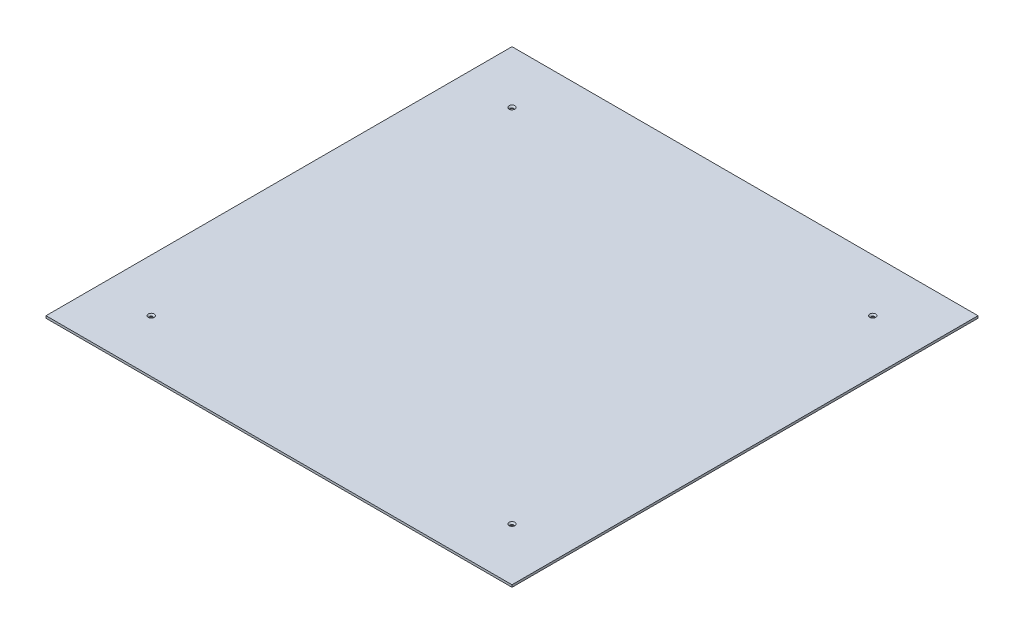
ISO-10303-21;
HEADER;
FILE_DESCRIPTION(('STEP AP214'),'2;1');
FILE_NAME('part.step','',(''),(''),'','','');
FILE_SCHEMA(('AUTOMOTIVE_DESIGN { 1 0 10303 214 1 1 1 1 }'));
ENDSEC;
DATA;
#1=APPLICATION_CONTEXT('core data for automotive mechanical design processes');
#2=APPLICATION_PROTOCOL_DEFINITION('international standard','automotive_design',2000,#1);
#3=PRODUCT_CONTEXT('',#1,'mechanical');
#4=PRODUCT('Part','Part','',(#3));
#5=PRODUCT_RELATED_PRODUCT_CATEGORY('part','',(#4));
#6=PRODUCT_DEFINITION_FORMATION('','',#4);
#7=PRODUCT_DEFINITION_CONTEXT('part definition',#1,'design');
#8=PRODUCT_DEFINITION('design','',#6,#7);
#9=PRODUCT_DEFINITION_SHAPE('','',#8);
#10=(LENGTH_UNIT() NAMED_UNIT(*) SI_UNIT(.MILLI.,.METRE.));
#11=(NAMED_UNIT(*) PLANE_ANGLE_UNIT() SI_UNIT($,.RADIAN.));
#12=(NAMED_UNIT(*) SI_UNIT($,.STERADIAN.) SOLID_ANGLE_UNIT());
#13=UNCERTAINTY_MEASURE_WITH_UNIT(LENGTH_MEASURE(1.E-05),#10,'distance_accuracy_value','');
#14=(GEOMETRIC_REPRESENTATION_CONTEXT(3) GLOBAL_UNCERTAINTY_ASSIGNED_CONTEXT((#13)) GLOBAL_UNIT_ASSIGNED_CONTEXT((#10,
#11,#12)) REPRESENTATION_CONTEXT('',''));
#15=CARTESIAN_POINT('',(0.,0.,0.));
#16=DIRECTION('',(0.,0.,1.));
#17=DIRECTION('',(1.,0.,0.));
#18=AXIS2_PLACEMENT_3D('',#15,#16,#17);
#19=CARTESIAN_POINT('',(155.,1.5,-155.));
#20=DIRECTION('',(-1.,0.,0.));
#21=DIRECTION('',(0.,0.,1.));
#22=AXIS2_PLACEMENT_3D('',#19,#20,#21);
#23=PLANE('',#22);
#24=DIRECTION('',(0.,0.,-1.));
#25=VECTOR('',#24,1.);
#26=CARTESIAN_POINT('',(155.,0.,-155.));
#27=LINE('',#26,#25);
#28=CARTESIAN_POINT('',(155.,0.,155.));
#29=VERTEX_POINT('',#28);
#30=CARTESIAN_POINT('',(155.,0.,-155.));
#31=VERTEX_POINT('',#30);
#32=EDGE_CURVE('E109',#29,#31,#27,.T.);
#33=ORIENTED_EDGE('',*,*,#32,.T.);
#34=DIRECTION('',(0.,-1.,0.));
#35=VECTOR('',#34,1.);
#36=CARTESIAN_POINT('',(155.,1.5,-155.));
#37=LINE('',#36,#35);
#38=CARTESIAN_POINT('',(155.,1.5,-155.));
#39=VERTEX_POINT('',#38);
#40=EDGE_CURVE('E11',#39,#31,#37,.T.);
#41=ORIENTED_EDGE('',*,*,#40,.F.);
#42=DIRECTION('',(0.,0.,-1.));
#43=VECTOR('',#42,1.);
#44=CARTESIAN_POINT('',(155.,1.5,-155.));
#45=LINE('',#44,#43);
#46=CARTESIAN_POINT('',(155.,1.5,155.));
#47=VERTEX_POINT('',#46);
#48=EDGE_CURVE('E93',#47,#39,#45,.T.);
#49=ORIENTED_EDGE('',*,*,#48,.F.);
#50=DIRECTION('',(0.,-1.,0.));
#51=VECTOR('',#50,1.);
#52=CARTESIAN_POINT('',(155.,1.5,155.));
#53=LINE('',#52,#51);
#54=EDGE_CURVE('E105',#47,#29,#53,.T.);
#55=ORIENTED_EDGE('',*,*,#54,.T.);
#56=EDGE_LOOP('',(#33,#41,#49,#55));
#57=FACE_BOUND('',#56,.T.);
#58=ADVANCED_FACE('F41',(#57),#23,.F.);
#59=CARTESIAN_POINT('',(-155.,1.5,-155.));
#60=DIRECTION('',(0.,0.,1.));
#61=DIRECTION('',(1.,0.,0.));
#62=AXIS2_PLACEMENT_3D('',#59,#60,#61);
#63=PLANE('',#62);
#64=DIRECTION('',(-1.,0.,0.));
#65=VECTOR('',#64,1.);
#66=CARTESIAN_POINT('',(-155.,0.,-155.));
#67=LINE('',#66,#65);
#68=CARTESIAN_POINT('',(-155.,0.,-155.));
#69=VERTEX_POINT('',#68);
#70=EDGE_CURVE('E98',#31,#69,#67,.T.);
#71=ORIENTED_EDGE('',*,*,#70,.T.);
#72=DIRECTION('',(0.,-1.,0.));
#73=VECTOR('',#72,1.);
#74=CARTESIAN_POINT('',(-155.,1.5,-155.));
#75=LINE('',#74,#73);
#76=CARTESIAN_POINT('',(-155.,1.5,-155.));
#77=VERTEX_POINT('',#76);
#78=EDGE_CURVE('E50',#77,#69,#75,.T.);
#79=ORIENTED_EDGE('',*,*,#78,.F.);
#80=DIRECTION('',(-1.,0.,0.));
#81=VECTOR('',#80,1.);
#82=CARTESIAN_POINT('',(-155.,1.5,-155.));
#83=LINE('',#82,#81);
#84=EDGE_CURVE('E88',#39,#77,#83,.T.);
#85=ORIENTED_EDGE('',*,*,#84,.F.);
#86=ORIENTED_EDGE('',*,*,#40,.T.);
#87=EDGE_LOOP('',(#71,#79,#85,#86));
#88=FACE_BOUND('',#87,.T.);
#89=ADVANCED_FACE('F97',(#88),#63,.F.);
#90=CARTESIAN_POINT('',(-155.,1.5,-155.));
#91=DIRECTION('',(1.,0.,0.));
#92=DIRECTION('',(0.,0.,-1.));
#93=AXIS2_PLACEMENT_3D('',#90,#91,#92);
#94=PLANE('',#93);
#95=DIRECTION('',(0.,0.,1.));
#96=VECTOR('',#95,1.);
#97=CARTESIAN_POINT('',(-155.,0.,-155.));
#98=LINE('',#97,#96);
#99=CARTESIAN_POINT('',(-155.,0.,155.));
#100=VERTEX_POINT('',#99);
#101=EDGE_CURVE('E75',#69,#100,#98,.T.);
#102=ORIENTED_EDGE('',*,*,#101,.T.);
#103=DIRECTION('',(0.,-1.,0.));
#104=VECTOR('',#103,1.);
#105=CARTESIAN_POINT('',(-155.,1.5,155.));
#106=LINE('',#105,#104);
#107=CARTESIAN_POINT('',(-155.,1.5,155.));
#108=VERTEX_POINT('',#107);
#109=EDGE_CURVE('E100',#108,#100,#106,.T.);
#110=ORIENTED_EDGE('',*,*,#109,.F.);
#111=DIRECTION('',(0.,0.,1.));
#112=VECTOR('',#111,1.);
#113=CARTESIAN_POINT('',(-155.,1.5,-155.));
#114=LINE('',#113,#112);
#115=EDGE_CURVE('E91',#77,#108,#114,.T.);
#116=ORIENTED_EDGE('',*,*,#115,.F.);
#117=ORIENTED_EDGE('',*,*,#78,.T.);
#118=EDGE_LOOP('',(#102,#110,#116,#117));
#119=FACE_BOUND('',#118,.T.);
#120=ADVANCED_FACE('F101',(#119),#94,.F.);
#121=CARTESIAN_POINT('',(-155.,1.5,155.));
#122=DIRECTION('',(0.,0.,-1.));
#123=DIRECTION('',(-1.,0.,0.));
#124=AXIS2_PLACEMENT_3D('',#121,#122,#123);
#125=PLANE('',#124);
#126=DIRECTION('',(1.,0.,0.));
#127=VECTOR('',#126,1.);
#128=CARTESIAN_POINT('',(-155.,0.,155.));
#129=LINE('',#128,#127);
#130=EDGE_CURVE('E81',#100,#29,#129,.T.);
#131=ORIENTED_EDGE('',*,*,#130,.T.);
#132=ORIENTED_EDGE('',*,*,#54,.F.);
#133=DIRECTION('',(1.,0.,0.));
#134=VECTOR('',#133,1.);
#135=CARTESIAN_POINT('',(-155.,1.5,155.));
#136=LINE('',#135,#134);
#137=EDGE_CURVE('E58',#108,#47,#136,.T.);
#138=ORIENTED_EDGE('',*,*,#137,.F.);
#139=ORIENTED_EDGE('',*,*,#109,.T.);
#140=EDGE_LOOP('',(#131,#132,#138,#139));
#141=FACE_BOUND('',#140,.T.);
#142=ADVANCED_FACE('F123',(#141),#125,.F.);
#143=CARTESIAN_POINT('',(0.,1.5,0.));
#144=DIRECTION('',(0.,1.,0.));
#145=DIRECTION('',(0.,0.,1.));
#146=AXIS2_PLACEMENT_3D('',#143,#144,#145);
#147=PLANE('',#146);
#148=CARTESIAN_POINT('',(-120.,1.5,-120.));
#149=DIRECTION('',(0.,1.,0.));
#150=DIRECTION('',(0.,0.,1.));
#151=AXIS2_PLACEMENT_3D('',#148,#149,#150);
#152=CIRCLE('',#151,2.);
#153=CARTESIAN_POINT('',(-120.,1.5,-118.));
#154=VERTEX_POINT('',#153);
#155=EDGE_CURVE('E173',#154,#154,#152,.T.);
#156=ORIENTED_EDGE('',*,*,#155,.F.);
#157=EDGE_LOOP('',(#156));
#158=FACE_BOUND('',#157,.T.);
#159=CARTESIAN_POINT('',(120.,1.5,-120.));
#160=DIRECTION('',(0.,1.,0.));
#161=DIRECTION('',(0.,0.,1.));
#162=AXIS2_PLACEMENT_3D('',#159,#160,#161);
#163=CIRCLE('',#162,2.);
#164=CARTESIAN_POINT('',(120.,1.5,-118.));
#165=VERTEX_POINT('',#164);
#166=EDGE_CURVE('E161',#165,#165,#163,.T.);
#167=ORIENTED_EDGE('',*,*,#166,.F.);
#168=EDGE_LOOP('',(#167));
#169=FACE_BOUND('',#168,.T.);
#170=CARTESIAN_POINT('',(120.000000000002,1.5,120.));
#171=DIRECTION('',(0.,1.,0.));
#172=DIRECTION('',(0.,0.,1.));
#173=AXIS2_PLACEMENT_3D('',#170,#171,#172);
#174=CIRCLE('',#173,2.);
#175=CARTESIAN_POINT('',(120.000000000002,1.5,122.));
#176=VERTEX_POINT('',#175);
#177=EDGE_CURVE('E149',#176,#176,#174,.T.);
#178=ORIENTED_EDGE('',*,*,#177,.F.);
#179=EDGE_LOOP('',(#178));
#180=FACE_BOUND('',#179,.T.);
#181=CARTESIAN_POINT('',(-119.999999999998,1.5,120.));
#182=DIRECTION('',(0.,1.,0.));
#183=DIRECTION('',(0.,0.,1.));
#184=AXIS2_PLACEMENT_3D('',#181,#182,#183);
#185=CIRCLE('',#184,2.);
#186=CARTESIAN_POINT('',(-119.999999999998,1.5,122.));
#187=VERTEX_POINT('',#186);
#188=EDGE_CURVE('E137',#187,#187,#185,.T.);
#189=ORIENTED_EDGE('',*,*,#188,.F.);
#190=EDGE_LOOP('',(#189));
#191=FACE_BOUND('',#190,.T.);
#192=ORIENTED_EDGE('',*,*,#48,.T.);
#193=ORIENTED_EDGE('',*,*,#84,.T.);
#194=ORIENTED_EDGE('',*,*,#115,.T.);
#195=ORIENTED_EDGE('',*,*,#137,.T.);
#196=EDGE_LOOP('',(#192,#193,#194,#195));
#197=FACE_BOUND('',#196,.T.);
#198=ADVANCED_FACE('F89',(#158,#169,#180,#191,#197),#147,.T.);
#199=CARTESIAN_POINT('',(0.,0.,0.));
#200=DIRECTION('',(0.,1.,0.));
#201=DIRECTION('',(0.,0.,1.));
#202=AXIS2_PLACEMENT_3D('',#199,#200,#201);
#203=PLANE('',#202);
#204=CARTESIAN_POINT('',(-120.,0.,-120.));
#205=DIRECTION('',(0.,1.,0.));
#206=DIRECTION('',(0.,0.,1.));
#207=AXIS2_PLACEMENT_3D('',#204,#205,#206);
#208=CIRCLE('',#207,1.05);
#209=CARTESIAN_POINT('',(-120.,0.,-118.95));
#210=VERTEX_POINT('',#209);
#211=EDGE_CURVE('E165',#210,#210,#208,.T.);
#212=ORIENTED_EDGE('',*,*,#211,.T.);
#213=EDGE_LOOP('',(#212));
#214=FACE_BOUND('',#213,.T.);
#215=CARTESIAN_POINT('',(120.,0.,-120.));
#216=DIRECTION('',(0.,1.,0.));
#217=DIRECTION('',(0.,0.,1.));
#218=AXIS2_PLACEMENT_3D('',#215,#216,#217);
#219=CIRCLE('',#218,1.05);
#220=CARTESIAN_POINT('',(120.,0.,-118.95));
#221=VERTEX_POINT('',#220);
#222=EDGE_CURVE('E153',#221,#221,#219,.T.);
#223=ORIENTED_EDGE('',*,*,#222,.T.);
#224=EDGE_LOOP('',(#223));
#225=FACE_BOUND('',#224,.T.);
#226=CARTESIAN_POINT('',(120.000000000002,0.,120.));
#227=DIRECTION('',(0.,1.,0.));
#228=DIRECTION('',(0.,0.,1.));
#229=AXIS2_PLACEMENT_3D('',#226,#227,#228);
#230=CIRCLE('',#229,1.05);
#231=CARTESIAN_POINT('',(120.000000000002,0.,121.05));
#232=VERTEX_POINT('',#231);
#233=EDGE_CURVE('E141',#232,#232,#230,.T.);
#234=ORIENTED_EDGE('',*,*,#233,.T.);
#235=EDGE_LOOP('',(#234));
#236=FACE_BOUND('',#235,.T.);
#237=CARTESIAN_POINT('',(-119.999999999998,0.,120.));
#238=DIRECTION('',(0.,1.,0.));
#239=DIRECTION('',(0.,0.,1.));
#240=AXIS2_PLACEMENT_3D('',#237,#238,#239);
#241=CIRCLE('',#240,1.05);
#242=CARTESIAN_POINT('',(-119.999999999998,0.,121.05));
#243=VERTEX_POINT('',#242);
#244=EDGE_CURVE('E113',#243,#243,#241,.T.);
#245=ORIENTED_EDGE('',*,*,#244,.T.);
#246=EDGE_LOOP('',(#245));
#247=FACE_BOUND('',#246,.T.);
#248=ORIENTED_EDGE('',*,*,#32,.F.);
#249=ORIENTED_EDGE('',*,*,#130,.F.);
#250=ORIENTED_EDGE('',*,*,#101,.F.);
#251=ORIENTED_EDGE('',*,*,#70,.F.);
#252=EDGE_LOOP('',(#248,#249,#250,#251));
#253=FACE_BOUND('',#252,.T.);
#254=ADVANCED_FACE('F126',(#214,#225,#236,#247,#253),#203,.F.);
#255=CARTESIAN_POINT('',(-119.999999999998,1.5,120.));
#256=DIRECTION('',(0.,1.,0.));
#257=DIRECTION('',(0.,0.,1.));
#258=AXIS2_PLACEMENT_3D('',#255,#256,#257);
#259=CYLINDRICAL_SURFACE('',#258,1.05);
#260=ORIENTED_EDGE('',*,*,#244,.F.);
#261=EDGE_LOOP('',(#260));
#262=FACE_BOUND('',#261,.T.);
#263=CARTESIAN_POINT('',(-119.999999999998,0.55,120.));
#264=DIRECTION('',(0.,1.,0.));
#265=DIRECTION('',(0.,0.,1.));
#266=AXIS2_PLACEMENT_3D('',#263,#264,#265);
#267=CIRCLE('',#266,1.05);
#268=CARTESIAN_POINT('',(-119.999999999998,0.55,121.05));
#269=VERTEX_POINT('',#268);
#270=EDGE_CURVE('E133',#269,#269,#267,.T.);
#271=ORIENTED_EDGE('',*,*,#270,.T.);
#272=EDGE_LOOP('',(#271));
#273=FACE_BOUND('',#272,.T.);
#274=ADVANCED_FACE('F192',(#262,#273),#259,.F.);
#275=CARTESIAN_POINT('',(-119.999999999998,1.5,120.));
#276=DIRECTION('',(0.,1.,0.));
#277=DIRECTION('',(0.,0.,1.));
#278=AXIS2_PLACEMENT_3D('',#275,#276,#277);
#279=CONICAL_SURFACE('',#278,2.,0.785398163397451);
#280=ORIENTED_EDGE('',*,*,#270,.F.);
#281=EDGE_LOOP('',(#280));
#282=FACE_BOUND('',#281,.T.);
#283=ORIENTED_EDGE('',*,*,#188,.T.);
#284=EDGE_LOOP('',(#283));
#285=FACE_BOUND('',#284,.T.);
#286=ADVANCED_FACE('F189',(#282,#285),#279,.F.);
#287=CARTESIAN_POINT('',(120.000000000002,1.5,120.));
#288=DIRECTION('',(0.,1.,0.));
#289=DIRECTION('',(0.,0.,1.));
#290=AXIS2_PLACEMENT_3D('',#287,#288,#289);
#291=CYLINDRICAL_SURFACE('',#290,1.05);
#292=ORIENTED_EDGE('',*,*,#233,.F.);
#293=EDGE_LOOP('',(#292));
#294=FACE_BOUND('',#293,.T.);
#295=CARTESIAN_POINT('',(120.000000000002,0.55,120.));
#296=DIRECTION('',(0.,1.,0.));
#297=DIRECTION('',(0.,0.,1.));
#298=AXIS2_PLACEMENT_3D('',#295,#296,#297);
#299=CIRCLE('',#298,1.05);
#300=CARTESIAN_POINT('',(120.000000000002,0.55,121.05));
#301=VERTEX_POINT('',#300);
#302=EDGE_CURVE('E145',#301,#301,#299,.T.);
#303=ORIENTED_EDGE('',*,*,#302,.T.);
#304=EDGE_LOOP('',(#303));
#305=FACE_BOUND('',#304,.T.);
#306=ADVANCED_FACE('F191',(#294,#305),#291,.F.);
#307=CARTESIAN_POINT('',(120.000000000002,1.5,120.));
#308=DIRECTION('',(0.,1.,0.));
#309=DIRECTION('',(0.,0.,1.));
#310=AXIS2_PLACEMENT_3D('',#307,#308,#309);
#311=CONICAL_SURFACE('',#310,2.,0.785398163397451);
#312=ORIENTED_EDGE('',*,*,#302,.F.);
#313=EDGE_LOOP('',(#312));
#314=FACE_BOUND('',#313,.T.);
#315=ORIENTED_EDGE('',*,*,#177,.T.);
#316=EDGE_LOOP('',(#315));
#317=FACE_BOUND('',#316,.T.);
#318=ADVANCED_FACE('F199',(#314,#317),#311,.F.);
#319=CARTESIAN_POINT('',(120.,1.5,-120.));
#320=DIRECTION('',(0.,1.,0.));
#321=DIRECTION('',(0.,0.,1.));
#322=AXIS2_PLACEMENT_3D('',#319,#320,#321);
#323=CYLINDRICAL_SURFACE('',#322,1.05);
#324=ORIENTED_EDGE('',*,*,#222,.F.);
#325=EDGE_LOOP('',(#324));
#326=FACE_BOUND('',#325,.T.);
#327=CARTESIAN_POINT('',(120.,0.55,-120.));
#328=DIRECTION('',(0.,1.,0.));
#329=DIRECTION('',(0.,0.,1.));
#330=AXIS2_PLACEMENT_3D('',#327,#328,#329);
#331=CIRCLE('',#330,1.05);
#332=CARTESIAN_POINT('',(120.,0.55,-118.95));
#333=VERTEX_POINT('',#332);
#334=EDGE_CURVE('E157',#333,#333,#331,.T.);
#335=ORIENTED_EDGE('',*,*,#334,.T.);
#336=EDGE_LOOP('',(#335));
#337=FACE_BOUND('',#336,.T.);
#338=ADVANCED_FACE('F233',(#326,#337),#323,.F.);
#339=CARTESIAN_POINT('',(120.,1.5,-120.));
#340=DIRECTION('',(0.,1.,0.));
#341=DIRECTION('',(0.,0.,1.));
#342=AXIS2_PLACEMENT_3D('',#339,#340,#341);
#343=CONICAL_SURFACE('',#342,2.,0.785398163397451);
#344=ORIENTED_EDGE('',*,*,#334,.F.);
#345=EDGE_LOOP('',(#344));
#346=FACE_BOUND('',#345,.T.);
#347=ORIENTED_EDGE('',*,*,#166,.T.);
#348=EDGE_LOOP('',(#347));
#349=FACE_BOUND('',#348,.T.);
#350=ADVANCED_FACE('F238',(#346,#349),#343,.F.);
#351=CARTESIAN_POINT('',(-120.,1.5,-120.));
#352=DIRECTION('',(0.,1.,0.));
#353=DIRECTION('',(0.,0.,1.));
#354=AXIS2_PLACEMENT_3D('',#351,#352,#353);
#355=CYLINDRICAL_SURFACE('',#354,1.05);
#356=ORIENTED_EDGE('',*,*,#211,.F.);
#357=EDGE_LOOP('',(#356));
#358=FACE_BOUND('',#357,.T.);
#359=CARTESIAN_POINT('',(-120.,0.55,-120.));
#360=DIRECTION('',(0.,1.,0.));
#361=DIRECTION('',(0.,0.,1.));
#362=AXIS2_PLACEMENT_3D('',#359,#360,#361);
#363=CIRCLE('',#362,1.05);
#364=CARTESIAN_POINT('',(-120.,0.55,-118.95));
#365=VERTEX_POINT('',#364);
#366=EDGE_CURVE('E169',#365,#365,#363,.T.);
#367=ORIENTED_EDGE('',*,*,#366,.T.);
#368=EDGE_LOOP('',(#367));
#369=FACE_BOUND('',#368,.T.);
#370=ADVANCED_FACE('F244',(#358,#369),#355,.F.);
#371=CARTESIAN_POINT('',(-120.,1.5,-120.));
#372=DIRECTION('',(0.,1.,0.));
#373=DIRECTION('',(0.,0.,1.));
#374=AXIS2_PLACEMENT_3D('',#371,#372,#373);
#375=CONICAL_SURFACE('',#374,2.,0.785398163397451);
#376=ORIENTED_EDGE('',*,*,#366,.F.);
#377=EDGE_LOOP('',(#376));
#378=FACE_BOUND('',#377,.T.);
#379=ORIENTED_EDGE('',*,*,#155,.T.);
#380=EDGE_LOOP('',(#379));
#381=FACE_BOUND('',#380,.T.);
#382=ADVANCED_FACE('F178',(#378,#381),#375,.F.);
#383=CLOSED_SHELL('',(#58,#89,#120,#142,#198,#254,#274,#286,#306,#318,#338,#350,#370,#382));
#384=MANIFOLD_SOLID_BREP('B2',#383);
#385=ADVANCED_BREP_SHAPE_REPRESENTATION('',(#18,#384),#14);
#386=SHAPE_DEFINITION_REPRESENTATION(#9,#385);
ENDSEC;
END-ISO-10303-21;
